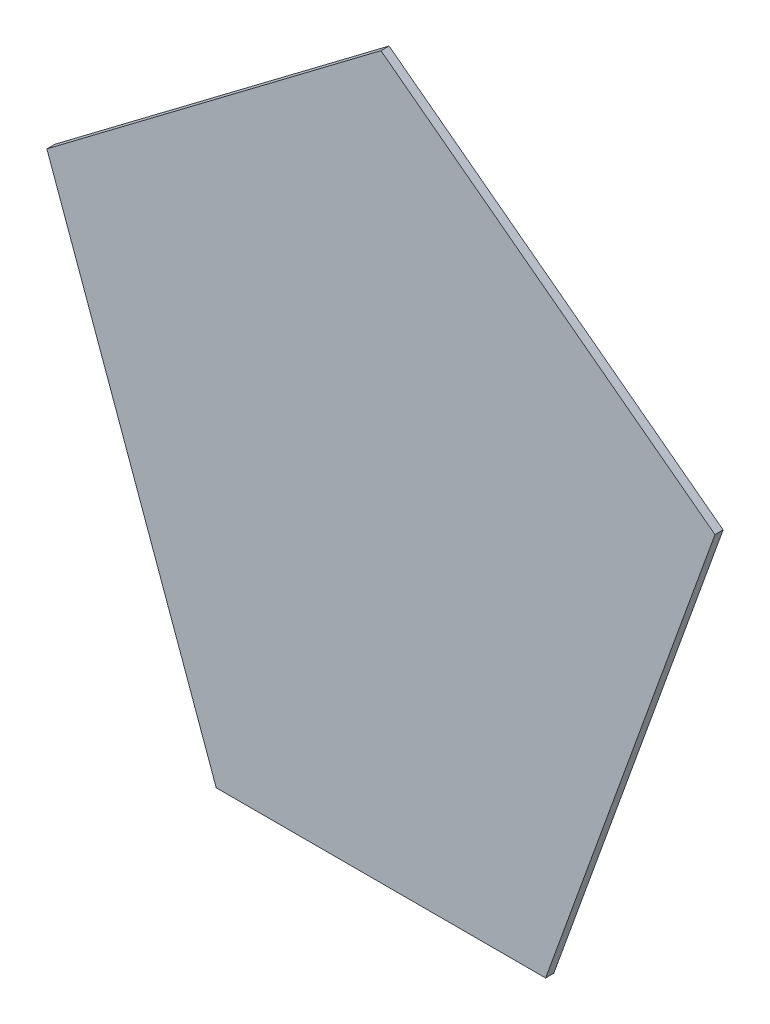
ISO-10303-21;
HEADER;
FILE_DESCRIPTION(('STEP AP214'),'2;1');
FILE_NAME('part.step','',(''),(''),'','','');
FILE_SCHEMA(('AUTOMOTIVE_DESIGN { 1 0 10303 214 1 1 1 1 }'));
ENDSEC;
DATA;
#1=APPLICATION_CONTEXT('core data for automotive mechanical design processes');
#2=APPLICATION_PROTOCOL_DEFINITION('international standard','automotive_design',2000,#1);
#3=PRODUCT_CONTEXT('',#1,'mechanical');
#4=PRODUCT('Part','Part','',(#3));
#5=PRODUCT_RELATED_PRODUCT_CATEGORY('part','',(#4));
#6=PRODUCT_DEFINITION_FORMATION('','',#4);
#7=PRODUCT_DEFINITION_CONTEXT('part definition',#1,'design');
#8=PRODUCT_DEFINITION('design','',#6,#7);
#9=PRODUCT_DEFINITION_SHAPE('','',#8);
#10=(LENGTH_UNIT() NAMED_UNIT(*) SI_UNIT(.MILLI.,.METRE.));
#11=(NAMED_UNIT(*) PLANE_ANGLE_UNIT() SI_UNIT($,.RADIAN.));
#12=(NAMED_UNIT(*) SI_UNIT($,.STERADIAN.) SOLID_ANGLE_UNIT());
#13=UNCERTAINTY_MEASURE_WITH_UNIT(LENGTH_MEASURE(1.E-05),#10,'distance_accuracy_value','');
#14=(GEOMETRIC_REPRESENTATION_CONTEXT(3) GLOBAL_UNCERTAINTY_ASSIGNED_CONTEXT((#13)) GLOBAL_UNIT_ASSIGNED_CONTEXT((#10,
#11,#12)) REPRESENTATION_CONTEXT('',''));
#15=CARTESIAN_POINT('',(0.,0.,0.));
#16=DIRECTION('',(0.,0.,1.));
#17=DIRECTION('',(1.,0.,0.));
#18=AXIS2_PLACEMENT_3D('',#15,#16,#17);
#19=CARTESIAN_POINT('',(-7.77249544863376,-270.026590050049,-3.5));
#20=DIRECTION('',(0.602308763969222,0.79826321025453,0.));
#21=DIRECTION('',(-0.79826321025453,0.602308763969222,0.));
#22=AXIS2_PLACEMENT_3D('',#19,#20,#21);
#23=PLANE('',#22);
#24=DIRECTION('',(-0.79826321025453,0.602308763969222,0.));
#25=VECTOR('',#24,1.);
#26=CARTESIAN_POINT('',(-7.77249544863376,-270.026590050049,0.));
#27=LINE('',#26,#25);
#28=CARTESIAN_POINT('',(135.914882397182,-378.442167564509,0.));
#29=VERTEX_POINT('',#28);
#30=CARTESIAN_POINT('',(-7.77249544863376,-270.026590050049,0.));
#31=VERTEX_POINT('',#30);
#32=EDGE_CURVE('E111',#29,#31,#27,.T.);
#33=ORIENTED_EDGE('',*,*,#32,.F.);
#34=DIRECTION('',(0.,0.,1.));
#35=VECTOR('',#34,1.);
#36=CARTESIAN_POINT('',(135.914882397182,-378.442167564509,-3.5));
#37=LINE('',#36,#35);
#38=CARTESIAN_POINT('',(135.914882397182,-378.442167564509,-3.5));
#39=VERTEX_POINT('',#38);
#40=EDGE_CURVE('E11',#39,#29,#37,.T.);
#41=ORIENTED_EDGE('',*,*,#40,.F.);
#42=DIRECTION('',(-0.79826321025453,0.602308763969222,0.));
#43=VECTOR('',#42,1.);
#44=CARTESIAN_POINT('',(-7.77249544863376,-270.026590050049,-3.5));
#45=LINE('',#44,#43);
#46=CARTESIAN_POINT('',(-7.77249544863376,-270.026590050049,-3.5));
#47=VERTEX_POINT('',#46);
#48=EDGE_CURVE('E106',#39,#47,#45,.T.);
#49=ORIENTED_EDGE('',*,*,#48,.T.);
#50=DIRECTION('',(0.,0.,1.));
#51=VECTOR('',#50,1.);
#52=CARTESIAN_POINT('',(-7.77249544863376,-270.026590050049,-3.5));
#53=LINE('',#52,#51);
#54=EDGE_CURVE('E37',#47,#31,#53,.T.);
#55=ORIENTED_EDGE('',*,*,#54,.T.);
#56=EDGE_LOOP('',(#33,#41,#49,#55));
#57=FACE_BOUND('',#56,.T.);
#58=ADVANCED_FACE('F34',(#57),#23,.T.);
#59=CARTESIAN_POINT('',(135.914882397182,-378.442167564509,-3.5));
#60=DIRECTION('',(0.940469002824146,-0.339879470881896,0.));
#61=DIRECTION('',(0.339879470881896,0.940469002824146,0.));
#62=AXIS2_PLACEMENT_3D('',#59,#60,#61);
#63=PLANE('',#62);
#64=DIRECTION('',(0.339879470881896,0.940469002824145,0.));
#65=VECTOR('',#64,1.);
#66=CARTESIAN_POINT('',(135.914882397182,-378.442167564509,0.));
#67=LINE('',#66,#65);
#68=CARTESIAN_POINT('',(63.0635639096237,-580.026590050049,0.));
#69=VERTEX_POINT('',#68);
#70=EDGE_CURVE('E120',#69,#29,#67,.T.);
#71=ORIENTED_EDGE('',*,*,#70,.F.);
#72=DIRECTION('',(0.,0.,1.));
#73=VECTOR('',#72,1.);
#74=CARTESIAN_POINT('',(63.0635639096237,-580.026590050049,-3.5));
#75=LINE('',#74,#73);
#76=CARTESIAN_POINT('',(63.0635639096237,-580.026590050049,-3.5));
#77=VERTEX_POINT('',#76);
#78=EDGE_CURVE('E43',#77,#69,#75,.T.);
#79=ORIENTED_EDGE('',*,*,#78,.F.);
#80=DIRECTION('',(0.339879470881896,0.940469002824145,0.));
#81=VECTOR('',#80,1.);
#82=CARTESIAN_POINT('',(135.914882397182,-378.442167564509,-3.5));
#83=LINE('',#82,#81);
#84=EDGE_CURVE('E101',#77,#39,#83,.T.);
#85=ORIENTED_EDGE('',*,*,#84,.T.);
#86=ORIENTED_EDGE('',*,*,#40,.T.);
#87=EDGE_LOOP('',(#71,#79,#85,#86));
#88=FACE_BOUND('',#87,.T.);
#89=ADVANCED_FACE('F126',(#88),#63,.T.);
#90=CARTESIAN_POINT('',(-78.6085548068911,-580.026590050049,-3.5));
#91=DIRECTION('',(0.,-1.,0.));
#92=DIRECTION('',(0.,0.,-1.));
#93=AXIS2_PLACEMENT_3D('',#90,#91,#92);
#94=PLANE('',#93);
#95=DIRECTION('',(1.,0.,0.));
#96=VECTOR('',#95,1.);
#97=CARTESIAN_POINT('',(-78.6085548068911,-580.026590050049,0.));
#98=LINE('',#97,#96);
#99=CARTESIAN_POINT('',(-78.6085548068911,-580.026590050049,0.));
#100=VERTEX_POINT('',#99);
#101=EDGE_CURVE('E90',#100,#69,#98,.T.);
#102=ORIENTED_EDGE('',*,*,#101,.F.);
#103=DIRECTION('',(0.,0.,1.));
#104=VECTOR('',#103,1.);
#105=CARTESIAN_POINT('',(-78.6085548068911,-580.026590050049,-3.5));
#106=LINE('',#105,#104);
#107=CARTESIAN_POINT('',(-78.6085548068911,-580.026590050049,-3.5));
#108=VERTEX_POINT('',#107);
#109=EDGE_CURVE('E85',#108,#100,#106,.T.);
#110=ORIENTED_EDGE('',*,*,#109,.F.);
#111=DIRECTION('',(1.,0.,0.));
#112=VECTOR('',#111,1.);
#113=CARTESIAN_POINT('',(-78.6085548068911,-580.026590050049,-3.5));
#114=LINE('',#113,#112);
#115=EDGE_CURVE('E88',#108,#77,#114,.T.);
#116=ORIENTED_EDGE('',*,*,#115,.T.);
#117=ORIENTED_EDGE('',*,*,#78,.T.);
#118=EDGE_LOOP('',(#102,#110,#116,#117));
#119=FACE_BOUND('',#118,.T.);
#120=ADVANCED_FACE('F87',(#119),#94,.T.);
#121=CARTESIAN_POINT('',(-151.459873294449,-378.442167564509,-3.5));
#122=DIRECTION('',(-0.940469002824145,-0.339879470881896,0.));
#123=DIRECTION('',(0.339879470881896,-0.940469002824145,0.));
#124=AXIS2_PLACEMENT_3D('',#121,#122,#123);
#125=PLANE('',#124);
#126=DIRECTION('',(0.339879470881896,-0.940469002824146,0.));
#127=VECTOR('',#126,1.);
#128=CARTESIAN_POINT('',(-151.459873294449,-378.442167564509,0.));
#129=LINE('',#128,#127);
#130=CARTESIAN_POINT('',(-151.459873294449,-378.442167564509,0.));
#131=VERTEX_POINT('',#130);
#132=EDGE_CURVE('E117',#131,#100,#129,.T.);
#133=ORIENTED_EDGE('',*,*,#132,.F.);
#134=DIRECTION('',(0.,0.,1.));
#135=VECTOR('',#134,1.);
#136=CARTESIAN_POINT('',(-151.459873294449,-378.442167564509,-3.5));
#137=LINE('',#136,#135);
#138=CARTESIAN_POINT('',(-151.459873294449,-378.442167564509,-3.5));
#139=VERTEX_POINT('',#138);
#140=EDGE_CURVE('E95',#139,#131,#137,.T.);
#141=ORIENTED_EDGE('',*,*,#140,.F.);
#142=DIRECTION('',(0.339879470881896,-0.940469002824146,0.));
#143=VECTOR('',#142,1.);
#144=CARTESIAN_POINT('',(-151.459873294449,-378.442167564509,-3.5));
#145=LINE('',#144,#143);
#146=EDGE_CURVE('E100',#139,#108,#145,.T.);
#147=ORIENTED_EDGE('',*,*,#146,.T.);
#148=ORIENTED_EDGE('',*,*,#109,.T.);
#149=EDGE_LOOP('',(#133,#141,#147,#148));
#150=FACE_BOUND('',#149,.T.);
#151=ADVANCED_FACE('F103',(#150),#125,.T.);
#152=CARTESIAN_POINT('',(-7.77249544863376,-270.026590050049,-3.5));
#153=DIRECTION('',(-0.602308763969222,0.79826321025453,0.));
#154=DIRECTION('',(-0.79826321025453,-0.602308763969222,0.));
#155=AXIS2_PLACEMENT_3D('',#152,#153,#154);
#156=PLANE('',#155);
#157=DIRECTION('',(-0.79826321025453,-0.602308763969222,0.));
#158=VECTOR('',#157,1.);
#159=CARTESIAN_POINT('',(-7.77249544863376,-270.026590050049,0.));
#160=LINE('',#159,#158);
#161=EDGE_CURVE('E114',#31,#131,#160,.T.);
#162=ORIENTED_EDGE('',*,*,#161,.F.);
#163=ORIENTED_EDGE('',*,*,#54,.F.);
#164=DIRECTION('',(-0.79826321025453,-0.602308763969222,0.));
#165=VECTOR('',#164,1.);
#166=CARTESIAN_POINT('',(-7.77249544863376,-270.026590050049,-3.5));
#167=LINE('',#166,#165);
#168=EDGE_CURVE('E104',#47,#139,#167,.T.);
#169=ORIENTED_EDGE('',*,*,#168,.T.);
#170=ORIENTED_EDGE('',*,*,#140,.T.);
#171=EDGE_LOOP('',(#162,#163,#169,#170));
#172=FACE_BOUND('',#171,.T.);
#173=ADVANCED_FACE('F123',(#172),#156,.T.);
#174=CARTESIAN_POINT('',(0.,0.,-3.5));
#175=DIRECTION('',(0.,0.,-1.));
#176=DIRECTION('',(-1.,0.,0.));
#177=AXIS2_PLACEMENT_3D('',#174,#175,#176);
#178=PLANE('',#177);
#179=ORIENTED_EDGE('',*,*,#48,.F.);
#180=ORIENTED_EDGE('',*,*,#84,.F.);
#181=ORIENTED_EDGE('',*,*,#115,.F.);
#182=ORIENTED_EDGE('',*,*,#146,.F.);
#183=ORIENTED_EDGE('',*,*,#168,.F.);
#184=EDGE_LOOP('',(#179,#180,#181,#182,#183));
#185=FACE_BOUND('',#184,.T.);
#186=ADVANCED_FACE('F99',(#185),#178,.T.);
#187=CARTESIAN_POINT('',(0.,0.,0.));
#188=DIRECTION('',(0.,0.,-1.));
#189=DIRECTION('',(-1.,0.,0.));
#190=AXIS2_PLACEMENT_3D('',#187,#188,#189);
#191=PLANE('',#190);
#192=ORIENTED_EDGE('',*,*,#32,.T.);
#193=ORIENTED_EDGE('',*,*,#161,.T.);
#194=ORIENTED_EDGE('',*,*,#132,.T.);
#195=ORIENTED_EDGE('',*,*,#101,.T.);
#196=ORIENTED_EDGE('',*,*,#70,.T.);
#197=EDGE_LOOP('',(#192,#193,#194,#195,#196));
#198=FACE_BOUND('',#197,.T.);
#199=ADVANCED_FACE('F125',(#198),#191,.F.);
#200=CLOSED_SHELL('',(#58,#89,#120,#151,#173,#186,#199));
#201=MANIFOLD_SOLID_BREP('B2',#200);
#202=ADVANCED_BREP_SHAPE_REPRESENTATION('',(#18,#201),#14);
#203=SHAPE_DEFINITION_REPRESENTATION(#9,#202);
ENDSEC;
END-ISO-10303-21;
